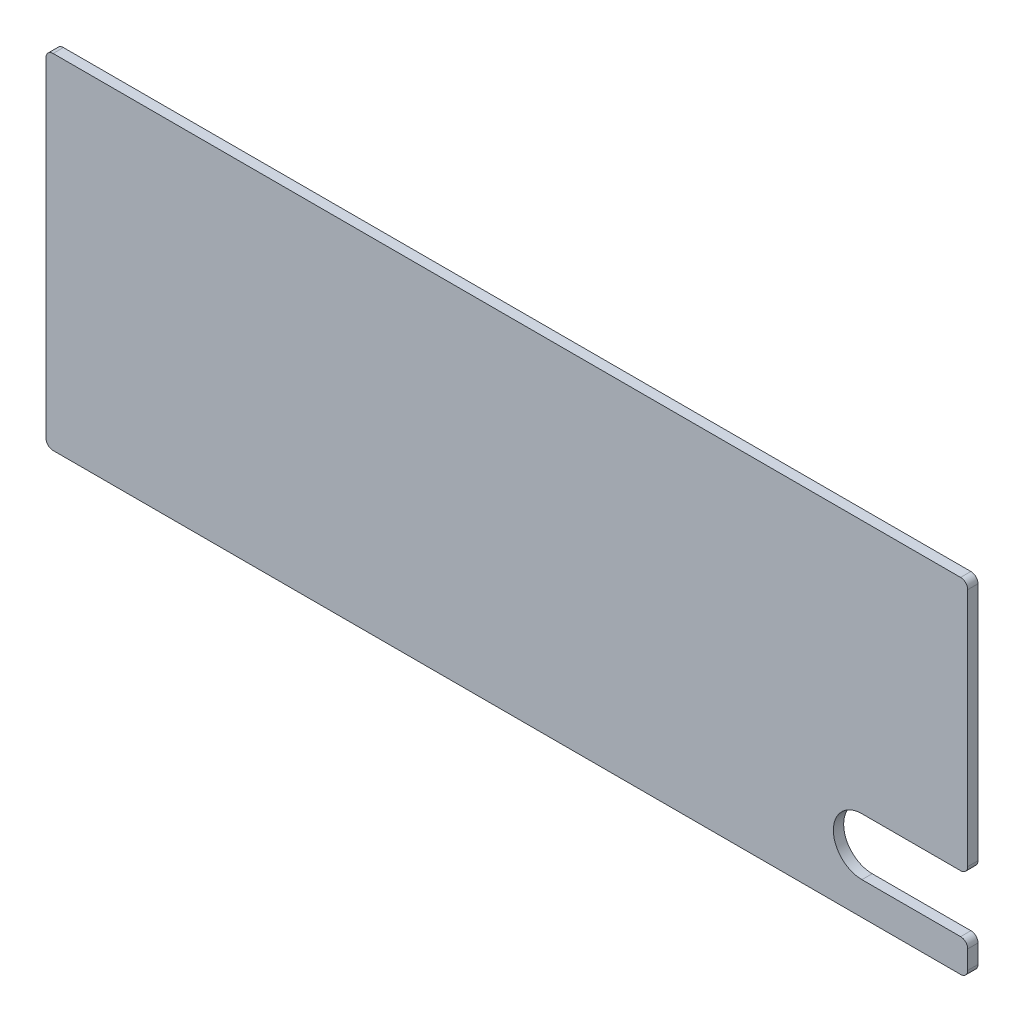
ISO-10303-21;
HEADER;
FILE_DESCRIPTION(('STEP AP214'),'2;1');
FILE_NAME('part.step','',(''),(''),'','','');
FILE_SCHEMA(('AUTOMOTIVE_DESIGN { 1 0 10303 214 1 1 1 1 }'));
ENDSEC;
DATA;
#1=APPLICATION_CONTEXT('core data for automotive mechanical design processes');
#2=APPLICATION_PROTOCOL_DEFINITION('international standard','automotive_design',2000,#1);
#3=PRODUCT_CONTEXT('',#1,'mechanical');
#4=PRODUCT('Part','Part','',(#3));
#5=PRODUCT_RELATED_PRODUCT_CATEGORY('part','',(#4));
#6=PRODUCT_DEFINITION_FORMATION('','',#4);
#7=PRODUCT_DEFINITION_CONTEXT('part definition',#1,'design');
#8=PRODUCT_DEFINITION('design','',#6,#7);
#9=PRODUCT_DEFINITION_SHAPE('','',#8);
#10=(LENGTH_UNIT() NAMED_UNIT(*) SI_UNIT(.MILLI.,.METRE.));
#11=(NAMED_UNIT(*) PLANE_ANGLE_UNIT() SI_UNIT($,.RADIAN.));
#12=(NAMED_UNIT(*) SI_UNIT($,.STERADIAN.) SOLID_ANGLE_UNIT());
#13=UNCERTAINTY_MEASURE_WITH_UNIT(LENGTH_MEASURE(1.E-05),#10,'distance_accuracy_value','');
#14=(GEOMETRIC_REPRESENTATION_CONTEXT(3) GLOBAL_UNCERTAINTY_ASSIGNED_CONTEXT((#13)) GLOBAL_UNIT_ASSIGNED_CONTEXT((#10,
#11,#12)) REPRESENTATION_CONTEXT('',''));
#15=CARTESIAN_POINT('',(0.,0.,0.));
#16=DIRECTION('',(0.,0.,1.));
#17=DIRECTION('',(1.,0.,0.));
#18=AXIS2_PLACEMENT_3D('',#15,#16,#17);
#19=CARTESIAN_POINT('',(130.,0.,1.45));
#20=DIRECTION('',(-1.,0.,0.));
#21=DIRECTION('',(0.,0.,1.));
#22=AXIS2_PLACEMENT_3D('',#19,#20,#21);
#23=PLANE('',#22);
#24=DIRECTION('',(0.,1.,0.));
#25=VECTOR('',#24,1.);
#26=CARTESIAN_POINT('',(130.,0.,1.45));
#27=LINE('',#26,#25);
#28=CARTESIAN_POINT('',(130.,1.,1.45));
#29=VERTEX_POINT('',#28);
#30=CARTESIAN_POINT('',(130.,3.62293045559234,1.45));
#31=VERTEX_POINT('',#30);
#32=EDGE_CURVE('E184',#29,#31,#27,.T.);
#33=ORIENTED_EDGE('',*,*,#32,.F.);
#34=DIRECTION('',(0.,0.,-1.));
#35=VECTOR('',#34,1.);
#36=CARTESIAN_POINT('',(130.,1.,1.45));
#37=LINE('',#36,#35);
#38=CARTESIAN_POINT('',(130.,1.,0.));
#39=VERTEX_POINT('',#38);
#40=EDGE_CURVE('E269',#29,#39,#37,.T.);
#41=ORIENTED_EDGE('',*,*,#40,.T.);
#42=DIRECTION('',(0.,1.,0.));
#43=VECTOR('',#42,1.);
#44=CARTESIAN_POINT('',(130.,0.,0.));
#45=LINE('',#44,#43);
#46=CARTESIAN_POINT('',(130.,3.62293045559234,0.));
#47=VERTEX_POINT('',#46);
#48=EDGE_CURVE('E203',#39,#47,#45,.T.);
#49=ORIENTED_EDGE('',*,*,#48,.T.);
#50=DIRECTION('',(0.,0.,1.));
#51=VECTOR('',#50,1.);
#52=CARTESIAN_POINT('',(130.,3.62293045559234,1.45));
#53=LINE('',#52,#51);
#54=EDGE_CURVE('E265',#47,#31,#53,.T.);
#55=ORIENTED_EDGE('',*,*,#54,.T.);
#56=EDGE_LOOP('',(#33,#41,#49,#55));
#57=FACE_BOUND('',#56,.T.);
#58=ADVANCED_FACE('F38',(#57),#23,.F.);
#59=CARTESIAN_POINT('',(0.,0.,1.45));
#60=DIRECTION('',(1.,0.,0.));
#61=DIRECTION('',(0.,0.,-1.));
#62=AXIS2_PLACEMENT_3D('',#59,#60,#61);
#63=PLANE('',#62);
#64=DIRECTION('',(0.,-1.,0.));
#65=VECTOR('',#64,1.);
#66=CARTESIAN_POINT('',(0.,0.,0.));
#67=LINE('',#66,#65);
#68=CARTESIAN_POINT('',(0.,47.5,0.));
#69=VERTEX_POINT('',#68);
#70=CARTESIAN_POINT('',(0.,1.,0.));
#71=VERTEX_POINT('',#70);
#72=EDGE_CURVE('E174',#69,#71,#67,.T.);
#73=ORIENTED_EDGE('',*,*,#72,.T.);
#74=DIRECTION('',(0.,0.,-1.));
#75=VECTOR('',#74,1.);
#76=CARTESIAN_POINT('',(0.,1.,1.45));
#77=LINE('',#76,#75);
#78=CARTESIAN_POINT('',(0.,1.,1.45));
#79=VERTEX_POINT('',#78);
#80=EDGE_CURVE('E11',#71,#79,#77,.F.);
#81=ORIENTED_EDGE('',*,*,#80,.T.);
#82=DIRECTION('',(0.,-1.,0.));
#83=VECTOR('',#82,1.);
#84=CARTESIAN_POINT('',(0.,0.,1.45));
#85=LINE('',#84,#83);
#86=CARTESIAN_POINT('',(0.,47.5,1.45));
#87=VERTEX_POINT('',#86);
#88=EDGE_CURVE('E176',#87,#79,#85,.T.);
#89=ORIENTED_EDGE('',*,*,#88,.F.);
#90=DIRECTION('',(0.,0.,-1.));
#91=VECTOR('',#90,1.);
#92=CARTESIAN_POINT('',(0.,47.5,1.45));
#93=LINE('',#92,#91);
#94=EDGE_CURVE('E47',#87,#69,#93,.T.);
#95=ORIENTED_EDGE('',*,*,#94,.T.);
#96=EDGE_LOOP('',(#73,#81,#89,#95));
#97=FACE_BOUND('',#96,.T.);
#98=ADVANCED_FACE('F287',(#97),#63,.F.);
#99=CARTESIAN_POINT('',(0.,0.,1.45));
#100=DIRECTION('',(0.,1.,0.));
#101=DIRECTION('',(0.,0.,1.));
#102=AXIS2_PLACEMENT_3D('',#99,#100,#101);
#103=PLANE('',#102);
#104=DIRECTION('',(1.,0.,0.));
#105=VECTOR('',#104,1.);
#106=CARTESIAN_POINT('',(0.,0.,0.));
#107=LINE('',#106,#105);
#108=CARTESIAN_POINT('',(1.,0.,0.));
#109=VERTEX_POINT('',#108);
#110=CARTESIAN_POINT('',(129.,0.,0.));
#111=VERTEX_POINT('',#110);
#112=EDGE_CURVE('E196',#109,#111,#107,.T.);
#113=ORIENTED_EDGE('',*,*,#112,.T.);
#114=DIRECTION('',(0.,0.,-1.));
#115=VECTOR('',#114,1.);
#116=CARTESIAN_POINT('',(129.,0.,1.45));
#117=LINE('',#116,#115);
#118=CARTESIAN_POINT('',(129.,0.,1.45));
#119=VERTEX_POINT('',#118);
#120=EDGE_CURVE('E54',#111,#119,#117,.F.);
#121=ORIENTED_EDGE('',*,*,#120,.T.);
#122=DIRECTION('',(1.,0.,0.));
#123=VECTOR('',#122,1.);
#124=CARTESIAN_POINT('',(0.,0.,1.45));
#125=LINE('',#124,#123);
#126=CARTESIAN_POINT('',(1.,0.,1.45));
#127=VERTEX_POINT('',#126);
#128=EDGE_CURVE('E179',#127,#119,#125,.T.);
#129=ORIENTED_EDGE('',*,*,#128,.F.);
#130=DIRECTION('',(0.,0.,-1.));
#131=VECTOR('',#130,1.);
#132=CARTESIAN_POINT('',(1.,0.,1.45));
#133=LINE('',#132,#131);
#134=EDGE_CURVE('E273',#127,#109,#133,.T.);
#135=ORIENTED_EDGE('',*,*,#134,.T.);
#136=EDGE_LOOP('',(#113,#121,#129,#135));
#137=FACE_BOUND('',#136,.T.);
#138=ADVANCED_FACE('F298',(#137),#103,.F.);
#139=CARTESIAN_POINT('',(130.,13.6737729249972,0.));
#140=VERTEX_POINT('',#139);
#141=CARTESIAN_POINT('',(130.,47.5,0.));
#142=VERTEX_POINT('',#141);
#143=EDGE_CURVE('E199',#140,#142,#45,.T.);
#144=ORIENTED_EDGE('',*,*,#143,.T.);
#145=DIRECTION('',(0.,0.,-1.));
#146=VECTOR('',#145,1.);
#147=CARTESIAN_POINT('',(130.,47.5,1.45));
#148=LINE('',#147,#146);
#149=CARTESIAN_POINT('',(130.,47.5,1.45));
#150=VERTEX_POINT('',#149);
#151=EDGE_CURVE('E243',#142,#150,#148,.F.);
#152=ORIENTED_EDGE('',*,*,#151,.T.);
#153=CARTESIAN_POINT('',(130.,13.6737729249972,1.45));
#154=VERTEX_POINT('',#153);
#155=EDGE_CURVE('E183',#154,#150,#27,.T.);
#156=ORIENTED_EDGE('',*,*,#155,.F.);
#157=DIRECTION('',(0.,0.,-1.));
#158=VECTOR('',#157,1.);
#159=CARTESIAN_POINT('',(130.,13.6737729249973,1.45));
#160=LINE('',#159,#158);
#161=EDGE_CURVE('E239',#154,#140,#160,.T.);
#162=ORIENTED_EDGE('',*,*,#161,.T.);
#163=EDGE_LOOP('',(#144,#152,#156,#162));
#164=FACE_BOUND('',#163,.T.);
#165=ADVANCED_FACE('F325',(#164),#23,.F.);
#166=CARTESIAN_POINT('',(0.,48.5,1.45));
#167=DIRECTION('',(0.,-1.,0.));
#168=DIRECTION('',(0.,0.,-1.));
#169=AXIS2_PLACEMENT_3D('',#166,#167,#168);
#170=PLANE('',#169);
#171=DIRECTION('',(-1.,0.,0.));
#172=VECTOR('',#171,1.);
#173=CARTESIAN_POINT('',(0.,48.5,1.45));
#174=LINE('',#173,#172);
#175=CARTESIAN_POINT('',(129.,48.5,1.45));
#176=VERTEX_POINT('',#175);
#177=CARTESIAN_POINT('',(1.,48.5,1.45));
#178=VERTEX_POINT('',#177);
#179=EDGE_CURVE('E188',#176,#178,#174,.T.);
#180=ORIENTED_EDGE('',*,*,#179,.F.);
#181=DIRECTION('',(0.,0.,-1.));
#182=VECTOR('',#181,1.);
#183=CARTESIAN_POINT('',(129.,48.5,1.45));
#184=LINE('',#183,#182);
#185=CARTESIAN_POINT('',(129.,48.5,0.));
#186=VERTEX_POINT('',#185);
#187=EDGE_CURVE('E217',#176,#186,#184,.T.);
#188=ORIENTED_EDGE('',*,*,#187,.T.);
#189=DIRECTION('',(-1.,0.,0.));
#190=VECTOR('',#189,1.);
#191=CARTESIAN_POINT('',(0.,48.5,0.));
#192=LINE('',#191,#190);
#193=CARTESIAN_POINT('',(1.,48.5,0.));
#194=VERTEX_POINT('',#193);
#195=EDGE_CURVE('E180',#186,#194,#192,.T.);
#196=ORIENTED_EDGE('',*,*,#195,.T.);
#197=DIRECTION('',(0.,0.,-1.));
#198=VECTOR('',#197,1.);
#199=CARTESIAN_POINT('',(1.,48.5,1.45));
#200=LINE('',#199,#198);
#201=EDGE_CURVE('E214',#194,#178,#200,.F.);
#202=ORIENTED_EDGE('',*,*,#201,.T.);
#203=EDGE_LOOP('',(#180,#188,#196,#202));
#204=FACE_BOUND('',#203,.T.);
#205=ADVANCED_FACE('F322',(#204),#170,.F.);
#206=CARTESIAN_POINT('',(0.,0.,1.45));
#207=DIRECTION('',(0.,0.,-1.));
#208=DIRECTION('',(-1.,0.,0.));
#209=AXIS2_PLACEMENT_3D('',#206,#207,#208);
#210=PLANE('',#209);
#211=ORIENTED_EDGE('',*,*,#155,.T.);
#212=CARTESIAN_POINT('',(129.,47.5,1.45));
#213=DIRECTION('',(0.,0.,-1.));
#214=DIRECTION('',(-1.,0.,0.));
#215=AXIS2_PLACEMENT_3D('',#212,#213,#214);
#216=CIRCLE('',#215,1.);
#217=EDGE_CURVE('E260',#150,#176,#216,.F.);
#218=ORIENTED_EDGE('',*,*,#217,.T.);
#219=ORIENTED_EDGE('',*,*,#179,.T.);
#220=CARTESIAN_POINT('',(1.,47.5,1.45));
#221=DIRECTION('',(0.,0.,-1.));
#222=DIRECTION('',(-1.,0.,0.));
#223=AXIS2_PLACEMENT_3D('',#220,#221,#222);
#224=CIRCLE('',#223,1.);
#225=EDGE_CURVE('E246',#178,#87,#224,.F.);
#226=ORIENTED_EDGE('',*,*,#225,.T.);
#227=ORIENTED_EDGE('',*,*,#88,.T.);
#228=CARTESIAN_POINT('',(1.,1.,1.45));
#229=DIRECTION('',(0.,0.,-1.));
#230=DIRECTION('',(-1.,0.,0.));
#231=AXIS2_PLACEMENT_3D('',#228,#229,#230);
#232=CIRCLE('',#231,1.);
#233=EDGE_CURVE('E61',#79,#127,#232,.F.);
#234=ORIENTED_EDGE('',*,*,#233,.T.);
#235=ORIENTED_EDGE('',*,*,#128,.T.);
#236=CARTESIAN_POINT('',(129.,1.,1.45));
#237=DIRECTION('',(0.,0.,-1.));
#238=DIRECTION('',(-1.,0.,0.));
#239=AXIS2_PLACEMENT_3D('',#236,#237,#238);
#240=CIRCLE('',#239,1.);
#241=EDGE_CURVE('E254',#119,#29,#240,.F.);
#242=ORIENTED_EDGE('',*,*,#241,.T.);
#243=ORIENTED_EDGE('',*,*,#32,.T.);
#244=CARTESIAN_POINT('',(129.,3.62293045559234,1.45));
#245=DIRECTION('',(0.,0.,-1.));
#246=DIRECTION('',(-1.,0.,0.));
#247=AXIS2_PLACEMENT_3D('',#244,#245,#246);
#248=CIRCLE('',#247,1.);
#249=CARTESIAN_POINT('',(129.,4.62293045559235,1.45));
#250=VERTEX_POINT('',#249);
#251=EDGE_CURVE('E251',#31,#250,#248,.F.);
#252=ORIENTED_EDGE('',*,*,#251,.T.);
#253=DIRECTION('',(1.,0.,0.));
#254=VECTOR('',#253,1.);
#255=CARTESIAN_POINT('',(144.922454277233,4.62293045559235,1.45));
#256=LINE('',#255,#254);
#257=CARTESIAN_POINT('',(115.077545722767,4.62293045559235,1.45));
#258=VERTEX_POINT('',#257);
#259=EDGE_CURVE('E163',#258,#250,#256,.T.);
#260=ORIENTED_EDGE('',*,*,#259,.F.);
#261=CARTESIAN_POINT('',(115.077545722767,8.6483516902948,1.45));
#262=DIRECTION('',(0.,0.,1.));
#263=DIRECTION('',(1.,0.,0.));
#264=AXIS2_PLACEMENT_3D('',#261,#262,#263);
#265=CIRCLE('',#264,4.02542123470245);
#266=CARTESIAN_POINT('',(115.077545722767,12.6737729249973,1.45));
#267=VERTEX_POINT('',#266);
#268=EDGE_CURVE('E151',#267,#258,#265,.T.);
#269=ORIENTED_EDGE('',*,*,#268,.F.);
#270=DIRECTION('',(-1.,0.,0.));
#271=VECTOR('',#270,1.);
#272=CARTESIAN_POINT('',(144.922454277233,12.6737729249973,1.45));
#273=LINE('',#272,#271);
#274=CARTESIAN_POINT('',(129.,12.6737729249973,1.45));
#275=VERTEX_POINT('',#274);
#276=EDGE_CURVE('E140',#275,#267,#273,.T.);
#277=ORIENTED_EDGE('',*,*,#276,.F.);
#278=CARTESIAN_POINT('',(129.,13.6737729249973,1.45));
#279=DIRECTION('',(0.,0.,-1.));
#280=DIRECTION('',(-1.,0.,0.));
#281=AXIS2_PLACEMENT_3D('',#278,#279,#280);
#282=CIRCLE('',#281,1.);
#283=EDGE_CURVE('E257',#275,#154,#282,.F.);
#284=ORIENTED_EDGE('',*,*,#283,.T.);
#285=EDGE_LOOP('',(#211,#218,#219,#226,#227,#234,#235,#242,#243,#252,#260,#269,#277,#284));
#286=FACE_BOUND('',#285,.T.);
#287=ADVANCED_FACE('F166',(#286),#210,.F.);
#288=CARTESIAN_POINT('',(0.,0.,0.));
#289=DIRECTION('',(0.,0.,-1.));
#290=DIRECTION('',(-1.,0.,0.));
#291=AXIS2_PLACEMENT_3D('',#288,#289,#290);
#292=PLANE('',#291);
#293=ORIENTED_EDGE('',*,*,#195,.F.);
#294=CARTESIAN_POINT('',(129.,47.5,0.));
#295=DIRECTION('',(0.,0.,-1.));
#296=DIRECTION('',(-1.,0.,0.));
#297=AXIS2_PLACEMENT_3D('',#294,#295,#296);
#298=CIRCLE('',#297,1.);
#299=EDGE_CURVE('E236',#186,#142,#298,.T.);
#300=ORIENTED_EDGE('',*,*,#299,.T.);
#301=ORIENTED_EDGE('',*,*,#143,.F.);
#302=CARTESIAN_POINT('',(129.,13.6737729249973,0.));
#303=DIRECTION('',(0.,0.,-1.));
#304=DIRECTION('',(-1.,0.,0.));
#305=AXIS2_PLACEMENT_3D('',#302,#303,#304);
#306=CIRCLE('',#305,1.);
#307=CARTESIAN_POINT('',(129.,12.6737729249973,0.));
#308=VERTEX_POINT('',#307);
#309=EDGE_CURVE('E233',#140,#308,#306,.T.);
#310=ORIENTED_EDGE('',*,*,#309,.T.);
#311=DIRECTION('',(1.,0.,0.));
#312=VECTOR('',#311,1.);
#313=CARTESIAN_POINT('',(0.,12.6737729249973,0.));
#314=LINE('',#313,#312);
#315=CARTESIAN_POINT('',(115.077545722767,12.6737729249973,0.));
#316=VERTEX_POINT('',#315);
#317=EDGE_CURVE('E192',#316,#308,#314,.T.);
#318=ORIENTED_EDGE('',*,*,#317,.F.);
#319=CARTESIAN_POINT('',(115.077545722767,8.6483516902948,0.));
#320=DIRECTION('',(0.,0.,-1.));
#321=DIRECTION('',(-1.,0.,0.));
#322=AXIS2_PLACEMENT_3D('',#319,#320,#321);
#323=CIRCLE('',#322,4.02542123470245);
#324=CARTESIAN_POINT('',(115.077545722767,4.62293045559235,0.));
#325=VERTEX_POINT('',#324);
#326=EDGE_CURVE('E159',#325,#316,#323,.T.);
#327=ORIENTED_EDGE('',*,*,#326,.F.);
#328=DIRECTION('',(-1.,0.,0.));
#329=VECTOR('',#328,1.);
#330=CARTESIAN_POINT('',(0.,4.62293045559235,0.));
#331=LINE('',#330,#329);
#332=CARTESIAN_POINT('',(129.,4.62293045559235,0.));
#333=VERTEX_POINT('',#332);
#334=EDGE_CURVE('E211',#333,#325,#331,.T.);
#335=ORIENTED_EDGE('',*,*,#334,.F.);
#336=CARTESIAN_POINT('',(129.,3.62293045559234,0.));
#337=DIRECTION('',(0.,0.,-1.));
#338=DIRECTION('',(-1.,0.,0.));
#339=AXIS2_PLACEMENT_3D('',#336,#337,#338);
#340=CIRCLE('',#339,1.);
#341=EDGE_CURVE('E227',#333,#47,#340,.T.);
#342=ORIENTED_EDGE('',*,*,#341,.T.);
#343=ORIENTED_EDGE('',*,*,#48,.F.);
#344=CARTESIAN_POINT('',(129.,1.,0.));
#345=DIRECTION('',(0.,0.,-1.));
#346=DIRECTION('',(-1.,0.,0.));
#347=AXIS2_PLACEMENT_3D('',#344,#345,#346);
#348=CIRCLE('',#347,1.);
#349=EDGE_CURVE('E230',#39,#111,#348,.T.);
#350=ORIENTED_EDGE('',*,*,#349,.T.);
#351=ORIENTED_EDGE('',*,*,#112,.F.);
#352=CARTESIAN_POINT('',(1.,1.,0.));
#353=DIRECTION('',(0.,0.,-1.));
#354=DIRECTION('',(-1.,0.,0.));
#355=AXIS2_PLACEMENT_3D('',#352,#353,#354);
#356=CIRCLE('',#355,1.);
#357=EDGE_CURVE('E224',#109,#71,#356,.T.);
#358=ORIENTED_EDGE('',*,*,#357,.T.);
#359=ORIENTED_EDGE('',*,*,#72,.F.);
#360=CARTESIAN_POINT('',(1.,47.5,0.));
#361=DIRECTION('',(0.,0.,-1.));
#362=DIRECTION('',(-1.,0.,0.));
#363=AXIS2_PLACEMENT_3D('',#360,#361,#362);
#364=CIRCLE('',#363,1.);
#365=EDGE_CURVE('E221',#69,#194,#364,.T.);
#366=ORIENTED_EDGE('',*,*,#365,.T.);
#367=EDGE_LOOP('',(#293,#300,#301,#310,#318,#327,#335,#342,#343,#350,#351,#358,#359,#366));
#368=FACE_BOUND('',#367,.T.);
#369=ADVANCED_FACE('F293',(#368),#292,.T.);
#370=CARTESIAN_POINT('',(144.922454277233,4.62293045559235,-10.55));
#371=DIRECTION('',(0.,-1.,0.));
#372=DIRECTION('',(0.,0.,-1.));
#373=AXIS2_PLACEMENT_3D('',#370,#371,#372);
#374=PLANE('',#373);
#375=ORIENTED_EDGE('',*,*,#259,.T.);
#376=DIRECTION('',(0.,0.,1.));
#377=VECTOR('',#376,1.);
#378=CARTESIAN_POINT('',(129.,4.62293045559235,-10.55));
#379=LINE('',#378,#377);
#380=EDGE_CURVE('E279',#250,#333,#379,.F.);
#381=ORIENTED_EDGE('',*,*,#380,.T.);
#382=ORIENTED_EDGE('',*,*,#334,.T.);
#383=DIRECTION('',(0.,0.,1.));
#384=VECTOR('',#383,1.);
#385=CARTESIAN_POINT('',(115.077545722767,4.62293045559235,-10.55));
#386=LINE('',#385,#384);
#387=EDGE_CURVE('E162',#325,#258,#386,.T.);
#388=ORIENTED_EDGE('',*,*,#387,.T.);
#389=EDGE_LOOP('',(#375,#381,#382,#388));
#390=FACE_BOUND('',#389,.T.);
#391=ADVANCED_FACE('F332',(#390),#374,.F.);
#392=CARTESIAN_POINT('',(144.922454277233,12.6737729249973,-10.55));
#393=DIRECTION('',(0.,1.,0.));
#394=DIRECTION('',(0.,0.,1.));
#395=AXIS2_PLACEMENT_3D('',#392,#393,#394);
#396=PLANE('',#395);
#397=ORIENTED_EDGE('',*,*,#317,.T.);
#398=DIRECTION('',(0.,0.,-1.));
#399=VECTOR('',#398,1.);
#400=CARTESIAN_POINT('',(129.,12.6737729249973,-10.55));
#401=LINE('',#400,#399);
#402=EDGE_CURVE('E147',#308,#275,#401,.F.);
#403=ORIENTED_EDGE('',*,*,#402,.T.);
#404=ORIENTED_EDGE('',*,*,#276,.T.);
#405=DIRECTION('',(0.,0.,1.));
#406=VECTOR('',#405,1.);
#407=CARTESIAN_POINT('',(115.077545722767,12.6737729249973,-10.55));
#408=LINE('',#407,#406);
#409=EDGE_CURVE('E144',#316,#267,#408,.T.);
#410=ORIENTED_EDGE('',*,*,#409,.F.);
#411=EDGE_LOOP('',(#397,#403,#404,#410));
#412=FACE_BOUND('',#411,.T.);
#413=ADVANCED_FACE('F143',(#412),#396,.F.);
#414=CARTESIAN_POINT('',(115.077545722767,8.6483516902948,-10.55));
#415=DIRECTION('',(0.,0.,1.));
#416=DIRECTION('',(1.,0.,0.));
#417=AXIS2_PLACEMENT_3D('',#414,#415,#416);
#418=CYLINDRICAL_SURFACE('',#417,4.02542123470245);
#419=ORIENTED_EDGE('',*,*,#326,.T.);
#420=ORIENTED_EDGE('',*,*,#409,.T.);
#421=ORIENTED_EDGE('',*,*,#268,.T.);
#422=ORIENTED_EDGE('',*,*,#387,.F.);
#423=EDGE_LOOP('',(#419,#420,#421,#422));
#424=FACE_BOUND('',#423,.T.);
#425=ADVANCED_FACE('F155',(#424),#418,.F.);
#426=CARTESIAN_POINT('',(129.,47.5,1.45));
#427=DIRECTION('',(0.,0.,-1.));
#428=DIRECTION('',(-1.,0.,0.));
#429=AXIS2_PLACEMENT_3D('',#426,#427,#428);
#430=CYLINDRICAL_SURFACE('',#429,1.);
#431=ORIENTED_EDGE('',*,*,#217,.F.);
#432=ORIENTED_EDGE('',*,*,#151,.F.);
#433=ORIENTED_EDGE('',*,*,#299,.F.);
#434=ORIENTED_EDGE('',*,*,#187,.F.);
#435=EDGE_LOOP('',(#431,#432,#433,#434));
#436=FACE_BOUND('',#435,.T.);
#437=ADVANCED_FACE('F320',(#436),#430,.T.);
#438=CARTESIAN_POINT('',(129.,13.6737729249973,1.45));
#439=DIRECTION('',(0.,0.,-1.));
#440=DIRECTION('',(-1.,0.,0.));
#441=AXIS2_PLACEMENT_3D('',#438,#439,#440);
#442=CYLINDRICAL_SURFACE('',#441,1.);
#443=ORIENTED_EDGE('',*,*,#283,.F.);
#444=ORIENTED_EDGE('',*,*,#402,.F.);
#445=ORIENTED_EDGE('',*,*,#309,.F.);
#446=ORIENTED_EDGE('',*,*,#161,.F.);
#447=EDGE_LOOP('',(#443,#444,#445,#446));
#448=FACE_BOUND('',#447,.T.);
#449=ADVANCED_FACE('F327',(#448),#442,.T.);
#450=CARTESIAN_POINT('',(129.,1.,1.45));
#451=DIRECTION('',(0.,0.,-1.));
#452=DIRECTION('',(-1.,0.,0.));
#453=AXIS2_PLACEMENT_3D('',#450,#451,#452);
#454=CYLINDRICAL_SURFACE('',#453,1.);
#455=ORIENTED_EDGE('',*,*,#241,.F.);
#456=ORIENTED_EDGE('',*,*,#120,.F.);
#457=ORIENTED_EDGE('',*,*,#349,.F.);
#458=ORIENTED_EDGE('',*,*,#40,.F.);
#459=EDGE_LOOP('',(#455,#456,#457,#458));
#460=FACE_BOUND('',#459,.T.);
#461=ADVANCED_FACE('F303',(#460),#454,.T.);
#462=CARTESIAN_POINT('',(129.,3.62293045559234,1.45));
#463=DIRECTION('',(0.,0.,1.));
#464=DIRECTION('',(1.,0.,0.));
#465=AXIS2_PLACEMENT_3D('',#462,#463,#464);
#466=CYLINDRICAL_SURFACE('',#465,1.);
#467=ORIENTED_EDGE('',*,*,#341,.F.);
#468=ORIENTED_EDGE('',*,*,#380,.F.);
#469=ORIENTED_EDGE('',*,*,#251,.F.);
#470=ORIENTED_EDGE('',*,*,#54,.F.);
#471=EDGE_LOOP('',(#467,#468,#469,#470));
#472=FACE_BOUND('',#471,.T.);
#473=ADVANCED_FACE('F331',(#472),#466,.T.);
#474=CARTESIAN_POINT('',(1.,1.,1.45));
#475=DIRECTION('',(0.,0.,-1.));
#476=DIRECTION('',(-1.,0.,0.));
#477=AXIS2_PLACEMENT_3D('',#474,#475,#476);
#478=CYLINDRICAL_SURFACE('',#477,1.);
#479=ORIENTED_EDGE('',*,*,#233,.F.);
#480=ORIENTED_EDGE('',*,*,#80,.F.);
#481=ORIENTED_EDGE('',*,*,#357,.F.);
#482=ORIENTED_EDGE('',*,*,#134,.F.);
#483=EDGE_LOOP('',(#479,#480,#481,#482));
#484=FACE_BOUND('',#483,.T.);
#485=ADVANCED_FACE('F297',(#484),#478,.T.);
#486=CARTESIAN_POINT('',(1.,47.5,1.45));
#487=DIRECTION('',(0.,0.,-1.));
#488=DIRECTION('',(-1.,0.,0.));
#489=AXIS2_PLACEMENT_3D('',#486,#487,#488);
#490=CYLINDRICAL_SURFACE('',#489,1.);
#491=ORIENTED_EDGE('',*,*,#225,.F.);
#492=ORIENTED_EDGE('',*,*,#201,.F.);
#493=ORIENTED_EDGE('',*,*,#365,.F.);
#494=ORIENTED_EDGE('',*,*,#94,.F.);
#495=EDGE_LOOP('',(#491,#492,#493,#494));
#496=FACE_BOUND('',#495,.T.);
#497=ADVANCED_FACE('F40',(#496),#490,.T.);
#498=CLOSED_SHELL('',(#58,#98,#138,#165,#205,#287,#369,#391,#413,#425,#437,#449,#461,#473,#485,#497));
#499=MANIFOLD_SOLID_BREP('B2',#498);
#500=ADVANCED_BREP_SHAPE_REPRESENTATION('',(#18,#499),#14);
#501=SHAPE_DEFINITION_REPRESENTATION(#9,#500);
ENDSEC;
END-ISO-10303-21;
